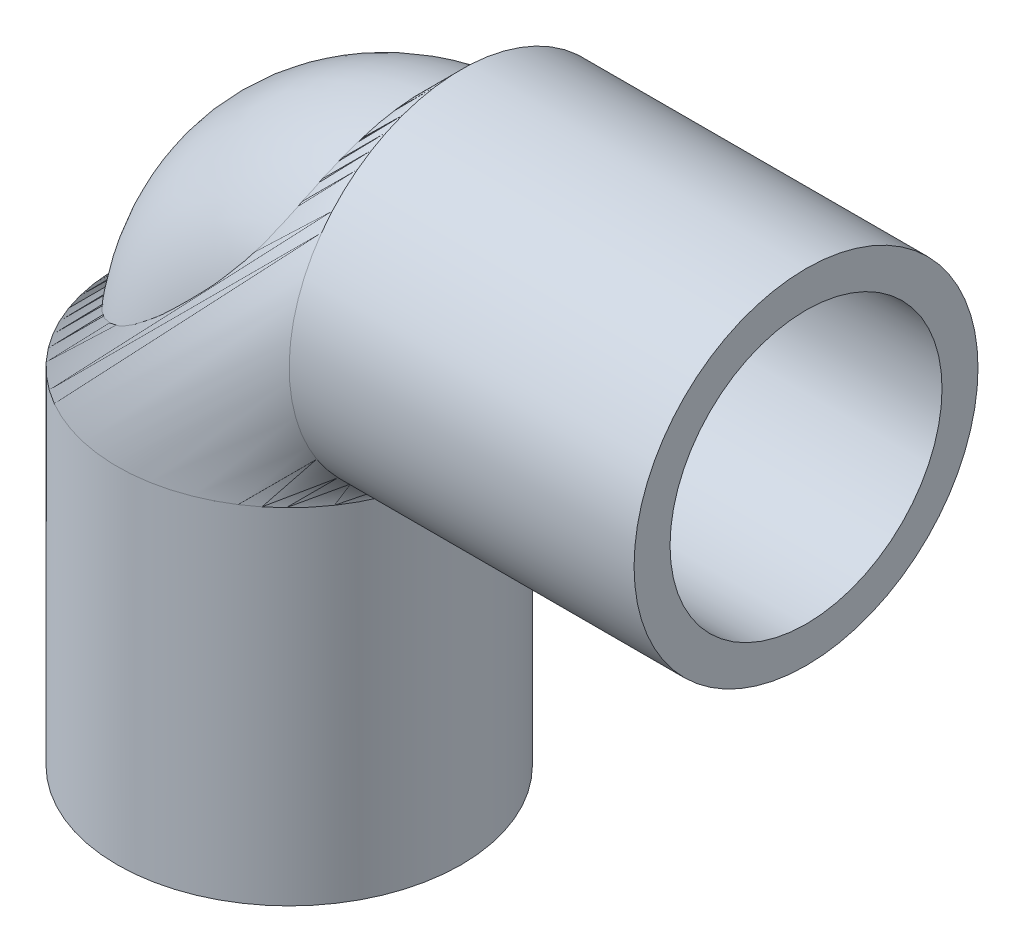
ISO-10303-21;
HEADER;
FILE_DESCRIPTION(('STEP AP214'),'2;1');
FILE_NAME('part.step','',(''),(''),'','','');
FILE_SCHEMA(('AUTOMOTIVE_DESIGN { 1 0 10303 214 1 1 1 1 }'));
ENDSEC;
DATA;
#1=APPLICATION_CONTEXT('core data for automotive mechanical design processes');
#2=APPLICATION_PROTOCOL_DEFINITION('international standard','automotive_design',2000,#1);
#3=PRODUCT_CONTEXT('',#1,'mechanical');
#4=PRODUCT('Part','Part','',(#3));
#5=PRODUCT_RELATED_PRODUCT_CATEGORY('part','',(#4));
#6=PRODUCT_DEFINITION_FORMATION('','',#4);
#7=PRODUCT_DEFINITION_CONTEXT('part definition',#1,'design');
#8=PRODUCT_DEFINITION('design','',#6,#7);
#9=PRODUCT_DEFINITION_SHAPE('','',#8);
#10=(LENGTH_UNIT() NAMED_UNIT(*) SI_UNIT(.MILLI.,.METRE.));
#11=(NAMED_UNIT(*) PLANE_ANGLE_UNIT() SI_UNIT($,.RADIAN.));
#12=(NAMED_UNIT(*) SI_UNIT($,.STERADIAN.) SOLID_ANGLE_UNIT());
#13=UNCERTAINTY_MEASURE_WITH_UNIT(LENGTH_MEASURE(1.E-05),#10,'distance_accuracy_value','');
#14=(GEOMETRIC_REPRESENTATION_CONTEXT(3) GLOBAL_UNCERTAINTY_ASSIGNED_CONTEXT((#13)) GLOBAL_UNIT_ASSIGNED_CONTEXT((#10,
#11,#12)) REPRESENTATION_CONTEXT('',''));
#15=CARTESIAN_POINT('',(0.,0.,0.));
#16=DIRECTION('',(0.,0.,1.));
#17=DIRECTION('',(1.,0.,0.));
#18=AXIS2_PLACEMENT_3D('',#15,#16,#17);
#19=CARTESIAN_POINT('',(16.637,50.,0.));
#20=DIRECTION('',(1.,0.,0.));
#21=DIRECTION('',(0.,0.,-1.));
#22=AXIS2_PLACEMENT_3D('',#19,#20,#21);
#23=CYLINDRICAL_SURFACE('',#22,16.637);
#24=CARTESIAN_POINT('',(50.,50.,0.));
#25=DIRECTION('',(1.,0.,0.));
#26=DIRECTION('',(0.,0.,1.));
#27=AXIS2_PLACEMENT_3D('',#24,#25,#26);
#28=CIRCLE('',#27,16.637);
#29=CARTESIAN_POINT('',(50.,50.,16.637));
#30=VERTEX_POINT('',#29);
#31=EDGE_CURVE('E11',#30,#30,#28,.T.);
#32=ORIENTED_EDGE('',*,*,#31,.F.);
#33=EDGE_LOOP('',(#32));
#34=FACE_BOUND('',#33,.T.);
#35=CARTESIAN_POINT('',(16.637,50.,0.));
#36=DIRECTION('',(1.,0.,0.));
#37=DIRECTION('',(0.,0.,1.));
#38=AXIS2_PLACEMENT_3D('',#35,#36,#37);
#39=CIRCLE('',#38,16.637);
#40=CARTESIAN_POINT('',(16.637,33.363,0.));
#41=VERTEX_POINT('',#40);
#42=EDGE_CURVE('E44',#41,#41,#39,.T.);
#43=ORIENTED_EDGE('',*,*,#42,.T.);
#44=EDGE_LOOP('',(#43));
#45=FACE_BOUND('',#44,.T.);
#46=ADVANCED_FACE('F34',(#34,#45),#23,.T.);
#47=CARTESIAN_POINT('',(16.637,50.,0.));
#48=DIRECTION('',(1.,0.,0.));
#49=DIRECTION('',(0.,0.,-1.));
#50=AXIS2_PLACEMENT_3D('',#47,#48,#49);
#51=CYLINDRICAL_SURFACE('',#50,13.1572);
#52=CARTESIAN_POINT('',(16.637,50.,0.));
#53=DIRECTION('',(1.,0.,0.));
#54=DIRECTION('',(0.,0.,1.));
#55=AXIS2_PLACEMENT_3D('',#52,#53,#54);
#56=CIRCLE('',#55,13.1572);
#57=CARTESIAN_POINT('',(16.637,63.1572,0.));
#58=VERTEX_POINT('',#57);
#59=EDGE_CURVE('E48',#58,#58,#56,.T.);
#60=ORIENTED_EDGE('',*,*,#59,.F.);
#61=EDGE_LOOP('',(#60));
#62=FACE_BOUND('',#61,.T.);
#63=CARTESIAN_POINT('',(50.,50.,0.));
#64=DIRECTION('',(1.,0.,0.));
#65=DIRECTION('',(0.,0.,1.));
#66=AXIS2_PLACEMENT_3D('',#63,#64,#65);
#67=CIRCLE('',#66,13.1572);
#68=CARTESIAN_POINT('',(50.,50.,13.1572));
#69=VERTEX_POINT('',#68);
#70=EDGE_CURVE('E40',#69,#69,#67,.T.);
#71=ORIENTED_EDGE('',*,*,#70,.T.);
#72=EDGE_LOOP('',(#71));
#73=FACE_BOUND('',#72,.T.);
#74=ADVANCED_FACE('F68',(#62,#73),#51,.F.);
#75=CARTESIAN_POINT('',(16.637,33.363,0.));
#76=DIRECTION('',(0.,0.,-1.));
#77=DIRECTION('',(-1.,0.,0.));
#78=AXIS2_PLACEMENT_3D('',#75,#76,#77);
#79=DEGENERATE_TOROIDAL_SURFACE('',#78,16.637,16.637,.T.);
#80=CARTESIAN_POINT('',(0.,33.363,0.));
#81=DIRECTION('',(0.,1.,0.));
#82=DIRECTION('',(0.,0.,1.));
#83=AXIS2_PLACEMENT_3D('',#80,#81,#82);
#84=CIRCLE('',#83,16.637);
#85=EDGE_CURVE('E50',#41,#41,#84,.T.);
#86=ORIENTED_EDGE('',*,*,#85,.T.);
#87=ORIENTED_EDGE('',*,*,#42,.F.);
#88=EDGE_LOOP('',(#86,#87));
#89=FACE_BOUND('',#88,.T.);
#90=ADVANCED_FACE('F51',(#89),#79,.T.);
#91=CARTESIAN_POINT('',(16.637,33.363,0.));
#92=DIRECTION('',(0.,0.,-1.));
#93=DIRECTION('',(-1.,0.,0.));
#94=AXIS2_PLACEMENT_3D('',#91,#92,#93);
#95=TOROIDAL_SURFACE('',#94,16.637,13.1572);
#96=CARTESIAN_POINT('',(0.,33.363,0.));
#97=DIRECTION('',(0.,1.,0.));
#98=DIRECTION('',(0.,0.,1.));
#99=AXIS2_PLACEMENT_3D('',#96,#97,#98);
#100=CIRCLE('',#99,13.1572);
#101=CARTESIAN_POINT('',(-13.1572,33.363,0.));
#102=VERTEX_POINT('',#101);
#103=EDGE_CURVE('E53',#102,#102,#100,.T.);
#104=CARTESIAN_POINT('',(16.637,33.363,0.));
#105=DIRECTION('',(0.,0.,-1.));
#106=DIRECTION('',(-1.,0.,0.));
#107=AXIS2_PLACEMENT_3D('',#104,#105,#106);
#108=CIRCLE('',#107,29.7942);
#109=EDGE_CURVE('',#102,#58,#108,.T.);
#110=ORIENTED_EDGE('',*,*,#103,.F.);
#111=ORIENTED_EDGE('',*,*,#59,.T.);
#112=ORIENTED_EDGE('',*,*,#109,.T.);
#113=ORIENTED_EDGE('',*,*,#109,.F.);
#114=EDGE_LOOP('',(#110,#112,#111,#113));
#115=FACE_BOUND('',#114,.T.);
#116=ADVANCED_FACE('F86',(#115),#95,.F.);
#117=CARTESIAN_POINT('',(0.,33.363,0.));
#118=DIRECTION('',(0.,-1.,0.));
#119=DIRECTION('',(0.,0.,-1.));
#120=AXIS2_PLACEMENT_3D('',#117,#118,#119);
#121=CYLINDRICAL_SURFACE('',#120,13.1572);
#122=ORIENTED_EDGE('',*,*,#103,.T.);
#123=EDGE_LOOP('',(#122));
#124=FACE_BOUND('',#123,.T.);
#125=CARTESIAN_POINT('',(0.,0.,0.));
#126=DIRECTION('',(0.,1.,0.));
#127=DIRECTION('',(0.,0.,1.));
#128=AXIS2_PLACEMENT_3D('',#125,#126,#127);
#129=CIRCLE('',#128,13.1572);
#130=CARTESIAN_POINT('',(0.,0.,13.1572));
#131=VERTEX_POINT('',#130);
#132=EDGE_CURVE('E61',#131,#131,#129,.T.);
#133=ORIENTED_EDGE('',*,*,#132,.F.);
#134=EDGE_LOOP('',(#133));
#135=FACE_BOUND('',#134,.T.);
#136=ADVANCED_FACE('F92',(#124,#135),#121,.F.);
#137=CARTESIAN_POINT('',(0.,33.363,0.));
#138=DIRECTION('',(0.,-1.,0.));
#139=DIRECTION('',(0.,0.,-1.));
#140=AXIS2_PLACEMENT_3D('',#137,#138,#139);
#141=CYLINDRICAL_SURFACE('',#140,16.637);
#142=ORIENTED_EDGE('',*,*,#85,.F.);
#143=EDGE_LOOP('',(#142));
#144=FACE_BOUND('',#143,.T.);
#145=CARTESIAN_POINT('',(0.,0.,0.));
#146=DIRECTION('',(0.,1.,0.));
#147=DIRECTION('',(0.,0.,1.));
#148=AXIS2_PLACEMENT_3D('',#145,#146,#147);
#149=CIRCLE('',#148,16.637);
#150=CARTESIAN_POINT('',(0.,0.,16.637));
#151=VERTEX_POINT('',#150);
#152=EDGE_CURVE('E58',#151,#151,#149,.T.);
#153=ORIENTED_EDGE('',*,*,#152,.T.);
#154=EDGE_LOOP('',(#153));
#155=FACE_BOUND('',#154,.T.);
#156=ADVANCED_FACE('F74',(#144,#155),#141,.T.);
#157=CARTESIAN_POINT('',(50.,50.,0.));
#158=DIRECTION('',(1.,0.,0.));
#159=DIRECTION('',(0.,0.,1.));
#160=AXIS2_PLACEMENT_3D('',#157,#158,#159);
#161=PLANE('',#160);
#162=ORIENTED_EDGE('',*,*,#70,.F.);
#163=EDGE_LOOP('',(#162));
#164=FACE_BOUND('',#163,.T.);
#165=ORIENTED_EDGE('',*,*,#31,.T.);
#166=EDGE_LOOP('',(#165));
#167=FACE_BOUND('',#166,.T.);
#168=ADVANCED_FACE('F70',(#164,#167),#161,.T.);
#169=CARTESIAN_POINT('',(0.,0.,0.));
#170=DIRECTION('',(0.,1.,0.));
#171=DIRECTION('',(0.,0.,1.));
#172=AXIS2_PLACEMENT_3D('',#169,#170,#171);
#173=PLANE('',#172);
#174=ORIENTED_EDGE('',*,*,#132,.T.);
#175=EDGE_LOOP('',(#174));
#176=FACE_BOUND('',#175,.T.);
#177=ORIENTED_EDGE('',*,*,#152,.F.);
#178=EDGE_LOOP('',(#177));
#179=FACE_BOUND('',#178,.T.);
#180=ADVANCED_FACE('F73',(#176,#179),#173,.F.);
#181=CLOSED_SHELL('',(#46,#74,#90,#116,#136,#156,#168,#180));
#182=MANIFOLD_SOLID_BREP('B2',#181);
#183=ADVANCED_BREP_SHAPE_REPRESENTATION('',(#18,#182),#14);
#184=SHAPE_DEFINITION_REPRESENTATION(#9,#183);
ENDSEC;
END-ISO-10303-21;
